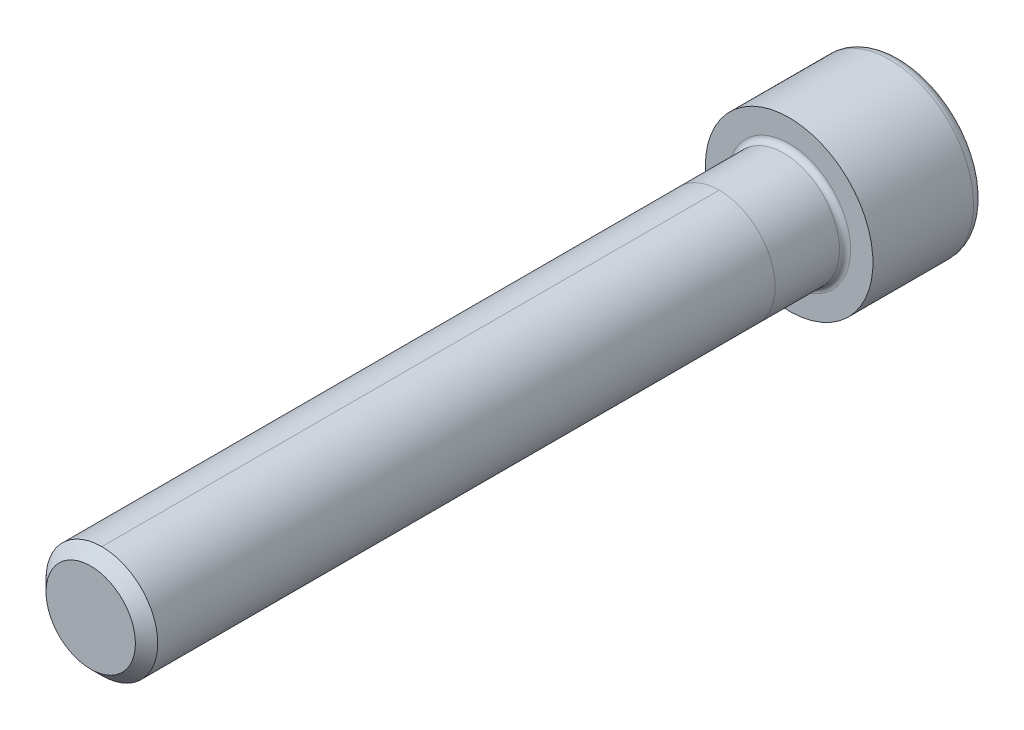
ISO-10303-21;
HEADER;
FILE_DESCRIPTION(('STEP AP214'),'2;1');
FILE_NAME('part.step','',(''),(''),'','','');
FILE_SCHEMA(('AUTOMOTIVE_DESIGN { 1 0 10303 214 1 1 1 1 }'));
ENDSEC;
DATA;
#1=APPLICATION_CONTEXT('core data for automotive mechanical design processes');
#2=APPLICATION_PROTOCOL_DEFINITION('international standard','automotive_design',2000,#1);
#3=PRODUCT_CONTEXT('',#1,'mechanical');
#4=PRODUCT('Part','Part','',(#3));
#5=PRODUCT_RELATED_PRODUCT_CATEGORY('part','',(#4));
#6=PRODUCT_DEFINITION_FORMATION('','',#4);
#7=PRODUCT_DEFINITION_CONTEXT('part definition',#1,'design');
#8=PRODUCT_DEFINITION('design','',#6,#7);
#9=PRODUCT_DEFINITION_SHAPE('','',#8);
#10=(LENGTH_UNIT() NAMED_UNIT(*) SI_UNIT(.MILLI.,.METRE.));
#11=(NAMED_UNIT(*) PLANE_ANGLE_UNIT() SI_UNIT($,.RADIAN.));
#12=(NAMED_UNIT(*) SI_UNIT($,.STERADIAN.) SOLID_ANGLE_UNIT());
#13=UNCERTAINTY_MEASURE_WITH_UNIT(LENGTH_MEASURE(1.E-05),#10,'distance_accuracy_value','');
#14=(GEOMETRIC_REPRESENTATION_CONTEXT(3) GLOBAL_UNCERTAINTY_ASSIGNED_CONTEXT((#13)) GLOBAL_UNIT_ASSIGNED_CONTEXT((#10,
#11,#12)) REPRESENTATION_CONTEXT('',''));
#15=CARTESIAN_POINT('',(0.,0.,0.));
#16=DIRECTION('',(0.,0.,1.));
#17=DIRECTION('',(1.,0.,0.));
#18=AXIS2_PLACEMENT_3D('',#15,#16,#17);
#19=CARTESIAN_POINT('',(0.,0.,75.));
#20=DIRECTION('',(0.,0.,-1.));
#21=DIRECTION('',(-1.,0.,0.));
#22=AXIS2_PLACEMENT_3D('',#19,#20,#21);
#23=CYLINDRICAL_SURFACE('',#22,6.);
#24=DIRECTION('',(0.,0.,-1.));
#25=VECTOR('',#24,1.);
#26=CARTESIAN_POINT('',(0.,6.,75.));
#27=LINE('',#26,#25);
#28=CARTESIAN_POINT('',(0.,6.,73.8));
#29=VERTEX_POINT('',#28);
#30=CARTESIAN_POINT('',(0.,6.,7.49999999999999));
#31=VERTEX_POINT('',#30);
#32=EDGE_CURVE('E58',#29,#31,#27,.T.);
#33=ORIENTED_EDGE('',*,*,#32,.F.);
#34=CARTESIAN_POINT('',(0.,0.,73.8));
#35=DIRECTION('',(0.,0.,1.));
#36=DIRECTION('',(1.,0.,0.));
#37=AXIS2_PLACEMENT_3D('',#34,#35,#36);
#38=CIRCLE('',#37,6.);
#39=CARTESIAN_POINT('',(0.,-6.,73.8));
#40=VERTEX_POINT('',#39);
#41=EDGE_CURVE('E192',#29,#40,#38,.F.);
#42=ORIENTED_EDGE('',*,*,#41,.T.);
#43=DIRECTION('',(0.,0.,-1.));
#44=VECTOR('',#43,1.);
#45=CARTESIAN_POINT('',(0.,-6.00000000000001,75.));
#46=LINE('',#45,#44);
#47=CARTESIAN_POINT('',(0.,-6.00000000000001,7.49999999999999));
#48=VERTEX_POINT('',#47);
#49=EDGE_CURVE('E195',#40,#48,#46,.T.);
#50=ORIENTED_EDGE('',*,*,#49,.T.);
#51=CARTESIAN_POINT('',(0.,0.,7.49999999999999));
#52=DIRECTION('',(0.,0.,1.));
#53=DIRECTION('',(0.,-1.,0.));
#54=AXIS2_PLACEMENT_3D('',#51,#52,#53);
#55=CIRCLE('',#54,6.);
#56=EDGE_CURVE('E64',#48,#31,#55,.T.);
#57=ORIENTED_EDGE('',*,*,#56,.T.);
#58=EDGE_LOOP('',(#33,#42,#50,#57));
#59=FACE_BOUND('',#58,.T.);
#60=ADVANCED_FACE('F43',(#59),#23,.T.);
#61=CARTESIAN_POINT('',(0.,0.,0.600000000000003));
#62=DIRECTION('',(0.,0.,-1.));
#63=DIRECTION('',(-1.,0.,0.));
#64=AXIS2_PLACEMENT_3D('',#61,#62,#63);
#65=CIRCLE('',#64,6.);
#66=CARTESIAN_POINT('',(-6.,0.,0.600000000000003));
#67=VERTEX_POINT('',#66);
#68=EDGE_CURVE('E12',#67,#67,#65,.F.);
#69=ORIENTED_EDGE('',*,*,#68,.T.);
#70=EDGE_LOOP('',(#69));
#71=FACE_BOUND('',#70,.T.);
#72=ORIENTED_EDGE('',*,*,#56,.F.);
#73=EDGE_CURVE('E217',#31,#48,#55,.T.);
#74=ORIENTED_EDGE('',*,*,#73,.F.);
#75=EDGE_LOOP('',(#72,#74));
#76=FACE_BOUND('',#75,.T.);
#77=ADVANCED_FACE('F235',(#71,#76),#23,.T.);
#78=EDGE_CURVE('E193',#40,#29,#38,.F.);
#79=ORIENTED_EDGE('',*,*,#78,.T.);
#80=ORIENTED_EDGE('',*,*,#32,.T.);
#81=ORIENTED_EDGE('',*,*,#73,.T.);
#82=ORIENTED_EDGE('',*,*,#49,.F.);
#83=EDGE_LOOP('',(#79,#80,#81,#82));
#84=FACE_BOUND('',#83,.T.);
#85=ADVANCED_FACE('F238',(#84),#23,.T.);
#86=CARTESIAN_POINT('',(0.,0.,75.));
#87=DIRECTION('',(0.,0.,1.));
#88=DIRECTION('',(1.,0.,0.));
#89=AXIS2_PLACEMENT_3D('',#86,#87,#88);
#90=PLANE('',#89);
#91=CARTESIAN_POINT('',(0.,0.,75.));
#92=DIRECTION('',(0.,0.,1.));
#93=DIRECTION('',(1.,0.,0.));
#94=AXIS2_PLACEMENT_3D('',#91,#92,#93);
#95=CIRCLE('',#94,4.8);
#96=CARTESIAN_POINT('',(4.8,0.,75.));
#97=VERTEX_POINT('',#96);
#98=EDGE_CURVE('E189',#97,#97,#95,.T.);
#99=ORIENTED_EDGE('',*,*,#98,.T.);
#100=EDGE_LOOP('',(#99));
#101=FACE_BOUND('',#100,.T.);
#102=ADVANCED_FACE('F246',(#101),#90,.T.);
#103=CARTESIAN_POINT('',(0.,0.,0.));
#104=DIRECTION('',(0.,0.,-1.));
#105=DIRECTION('',(-1.,0.,0.));
#106=AXIS2_PLACEMENT_3D('',#103,#104,#105);
#107=PLANE('',#106);
#108=CARTESIAN_POINT('',(0.,0.,0.));
#109=DIRECTION('',(0.,0.,-1.));
#110=DIRECTION('',(-1.,0.,0.));
#111=AXIS2_PLACEMENT_3D('',#108,#109,#110);
#112=CIRCLE('',#111,6.6);
#113=CARTESIAN_POINT('',(-6.6,0.,0.));
#114=VERTEX_POINT('',#113);
#115=EDGE_CURVE('E51',#114,#114,#112,.T.);
#116=ORIENTED_EDGE('',*,*,#115,.T.);
#117=EDGE_LOOP('',(#116));
#118=FACE_BOUND('',#117,.T.);
#119=CARTESIAN_POINT('',(0.,0.,0.));
#120=DIRECTION('',(0.,0.,-1.));
#121=DIRECTION('',(-1.,0.,0.));
#122=AXIS2_PLACEMENT_3D('',#119,#120,#121);
#123=CIRCLE('',#122,9.);
#124=CARTESIAN_POINT('',(-9.,0.,0.));
#125=VERTEX_POINT('',#124);
#126=EDGE_CURVE('E179',#125,#125,#123,.T.);
#127=ORIENTED_EDGE('',*,*,#126,.F.);
#128=EDGE_LOOP('',(#127));
#129=FACE_BOUND('',#128,.T.);
#130=ADVANCED_FACE('F224',(#118,#129),#107,.F.);
#131=CARTESIAN_POINT('',(0.,0.,-12.));
#132=DIRECTION('',(0.,0.,1.));
#133=DIRECTION('',(1.,0.,0.));
#134=AXIS2_PLACEMENT_3D('',#131,#132,#133);
#135=CYLINDRICAL_SURFACE('',#134,9.);
#136=CARTESIAN_POINT('',(0.,0.,-10.8));
#137=DIRECTION('',(0.,0.,-1.));
#138=DIRECTION('',(-1.,0.,0.));
#139=AXIS2_PLACEMENT_3D('',#136,#137,#138);
#140=CIRCLE('',#139,9.);
#141=CARTESIAN_POINT('',(-9.,0.,-10.8));
#142=VERTEX_POINT('',#141);
#143=EDGE_CURVE('E186',#142,#142,#140,.F.);
#144=ORIENTED_EDGE('',*,*,#143,.T.);
#145=EDGE_LOOP('',(#144));
#146=FACE_BOUND('',#145,.T.);
#147=ORIENTED_EDGE('',*,*,#126,.T.);
#148=EDGE_LOOP('',(#147));
#149=FACE_BOUND('',#148,.T.);
#150=ADVANCED_FACE('F282',(#146,#149),#135,.T.);
#151=CARTESIAN_POINT('',(0.,0.,-12.));
#152=DIRECTION('',(0.,0.,-1.));
#153=DIRECTION('',(-1.,0.,0.));
#154=AXIS2_PLACEMENT_3D('',#151,#152,#153);
#155=PLANE('',#154);
#156=DIRECTION('',(0.5,-0.866025403784439,0.));
#157=VECTOR('',#156,1.);
#158=CARTESIAN_POINT('',(2.88675134594813,5.,-12.));
#159=LINE('',#158,#157);
#160=CARTESIAN_POINT('',(2.88675134594813,5.,-12.));
#161=VERTEX_POINT('',#160);
#162=CARTESIAN_POINT('',(5.77350269189626,0.,-12.));
#163=VERTEX_POINT('',#162);
#164=EDGE_CURVE('E122',#161,#163,#159,.T.);
#165=ORIENTED_EDGE('',*,*,#164,.F.);
#166=DIRECTION('',(1.,0.,0.));
#167=VECTOR('',#166,1.);
#168=CARTESIAN_POINT('',(-2.88675134594813,5.,-12.));
#169=LINE('',#168,#167);
#170=CARTESIAN_POINT('',(-2.88675134594813,5.,-12.));
#171=VERTEX_POINT('',#170);
#172=EDGE_CURVE('E176',#171,#161,#169,.T.);
#173=ORIENTED_EDGE('',*,*,#172,.F.);
#174=DIRECTION('',(0.5,0.866025403784439,0.));
#175=VECTOR('',#174,1.);
#176=CARTESIAN_POINT('',(-5.77350269189626,0.,-12.));
#177=LINE('',#176,#175);
#178=CARTESIAN_POINT('',(-5.77350269189626,0.,-12.));
#179=VERTEX_POINT('',#178);
#180=EDGE_CURVE('E173',#179,#171,#177,.T.);
#181=ORIENTED_EDGE('',*,*,#180,.F.);
#182=DIRECTION('',(-0.5,0.866025403784439,0.));
#183=VECTOR('',#182,1.);
#184=CARTESIAN_POINT('',(-2.88675134594813,-5.,-12.));
#185=LINE('',#184,#183);
#186=CARTESIAN_POINT('',(-2.88675134594813,-5.,-12.));
#187=VERTEX_POINT('',#186);
#188=EDGE_CURVE('E170',#187,#179,#185,.T.);
#189=ORIENTED_EDGE('',*,*,#188,.F.);
#190=DIRECTION('',(-1.,0.,0.));
#191=VECTOR('',#190,1.);
#192=CARTESIAN_POINT('',(2.88675134594813,-5.,-12.));
#193=LINE('',#192,#191);
#194=CARTESIAN_POINT('',(2.88675134594813,-5.,-12.));
#195=VERTEX_POINT('',#194);
#196=EDGE_CURVE('E167',#195,#187,#193,.T.);
#197=ORIENTED_EDGE('',*,*,#196,.F.);
#198=DIRECTION('',(-0.5,-0.866025403784439,0.));
#199=VECTOR('',#198,1.);
#200=CARTESIAN_POINT('',(5.77350269189626,0.,-12.));
#201=LINE('',#200,#199);
#202=EDGE_CURVE('E164',#163,#195,#201,.T.);
#203=ORIENTED_EDGE('',*,*,#202,.F.);
#204=EDGE_LOOP('',(#165,#173,#181,#189,#197,#203));
#205=FACE_BOUND('',#204,.T.);
#206=CARTESIAN_POINT('',(0.,0.,-12.));
#207=DIRECTION('',(0.,0.,-1.));
#208=DIRECTION('',(-1.,0.,0.));
#209=AXIS2_PLACEMENT_3D('',#206,#207,#208);
#210=CIRCLE('',#209,7.8);
#211=CARTESIAN_POINT('',(-7.8,0.,-12.));
#212=VERTEX_POINT('',#211);
#213=EDGE_CURVE('E182',#212,#212,#210,.T.);
#214=ORIENTED_EDGE('',*,*,#213,.T.);
#215=EDGE_LOOP('',(#214));
#216=FACE_BOUND('',#215,.T.);
#217=ADVANCED_FACE('F277',(#205,#216),#155,.T.);
#218=CARTESIAN_POINT('',(0.,0.,-10.8));
#219=DIRECTION('',(0.,0.,-1.));
#220=DIRECTION('',(-1.,0.,0.));
#221=AXIS2_PLACEMENT_3D('',#218,#219,#220);
#222=TOROIDAL_SURFACE('',#221,7.8,1.2);
#223=ORIENTED_EDGE('',*,*,#143,.F.);
#224=EDGE_LOOP('',(#223));
#225=FACE_BOUND('',#224,.T.);
#226=ORIENTED_EDGE('',*,*,#213,.F.);
#227=EDGE_LOOP('',(#226));
#228=FACE_BOUND('',#227,.T.);
#229=ADVANCED_FACE('F268',(#225,#228),#222,.T.);
#230=CARTESIAN_POINT('',(0.,0.,75.));
#231=DIRECTION('',(0.,0.,-1.));
#232=DIRECTION('',(-1.,0.,0.));
#233=AXIS2_PLACEMENT_3D('',#230,#231,#232);
#234=CONICAL_SURFACE('',#233,4.8,0.785398163397452);
#235=ORIENTED_EDGE('',*,*,#78,.F.);
#236=ORIENTED_EDGE('',*,*,#41,.F.);
#237=EDGE_LOOP('',(#235,#236));
#238=FACE_BOUND('',#237,.T.);
#239=ORIENTED_EDGE('',*,*,#98,.F.);
#240=EDGE_LOOP('',(#239));
#241=FACE_BOUND('',#240,.T.);
#242=ADVANCED_FACE('F255',(#238,#241),#234,.T.);
#243=CARTESIAN_POINT('',(2.88675134594813,5.,-7.55555555555556));
#244=DIRECTION('',(0.866025403784439,0.5,0.));
#245=DIRECTION('',(-0.5,0.866025403784439,0.));
#246=AXIS2_PLACEMENT_3D('',#243,#244,#245);
#247=PLANE('',#246);
#248=ORIENTED_EDGE('',*,*,#164,.T.);
#249=DIRECTION('',(0.,0.,-1.));
#250=VECTOR('',#249,1.);
#251=CARTESIAN_POINT('',(5.77350269189626,0.,-7.55555555555556));
#252=LINE('',#251,#250);
#253=CARTESIAN_POINT('',(5.77350269189626,0.,-7.55555555555556));
#254=VERTEX_POINT('',#253);
#255=EDGE_CURVE('E200',#254,#163,#252,.T.);
#256=ORIENTED_EDGE('',*,*,#255,.F.);
#257=DIRECTION('',(-0.5,0.866025403784439,0.));
#258=VECTOR('',#257,1.);
#259=CARTESIAN_POINT('',(5.77350269189626,0.,-7.55555555555556));
#260=LINE('',#259,#258);
#261=CARTESIAN_POINT('',(2.88675134594813,5.,-7.55555555555556));
#262=VERTEX_POINT('',#261);
#263=EDGE_CURVE('E117',#262,#254,#260,.F.);
#264=ORIENTED_EDGE('',*,*,#263,.F.);
#265=DIRECTION('',(0.,0.,-1.));
#266=VECTOR('',#265,1.);
#267=CARTESIAN_POINT('',(2.88675134594813,5.,-7.55555555555556));
#268=LINE('',#267,#266);
#269=EDGE_CURVE('E183',#262,#161,#268,.T.);
#270=ORIENTED_EDGE('',*,*,#269,.T.);
#271=EDGE_LOOP('',(#248,#256,#264,#270));
#272=FACE_BOUND('',#271,.T.);
#273=ADVANCED_FACE('F267',(#272),#247,.F.);
#274=CARTESIAN_POINT('',(-2.88675134594813,5.,-7.55555555555556));
#275=DIRECTION('',(0.,1.,0.));
#276=DIRECTION('',(-1.,0.,0.));
#277=AXIS2_PLACEMENT_3D('',#274,#275,#276);
#278=PLANE('',#277);
#279=ORIENTED_EDGE('',*,*,#172,.T.);
#280=ORIENTED_EDGE('',*,*,#269,.F.);
#281=DIRECTION('',(1.,0.,0.));
#282=VECTOR('',#281,1.);
#283=CARTESIAN_POINT('',(0.,5.,-7.55555555555556));
#284=LINE('',#283,#282);
#285=CARTESIAN_POINT('',(-2.88675134594813,5.,-7.55555555555556));
#286=VERTEX_POINT('',#285);
#287=EDGE_CURVE('E131',#286,#262,#284,.T.);
#288=ORIENTED_EDGE('',*,*,#287,.F.);
#289=DIRECTION('',(0.,0.,-1.));
#290=VECTOR('',#289,1.);
#291=CARTESIAN_POINT('',(-2.88675134594813,5.,-7.55555555555556));
#292=LINE('',#291,#290);
#293=EDGE_CURVE('E196',#286,#171,#292,.T.);
#294=ORIENTED_EDGE('',*,*,#293,.T.);
#295=EDGE_LOOP('',(#279,#280,#288,#294));
#296=FACE_BOUND('',#295,.T.);
#297=ADVANCED_FACE('F274',(#296),#278,.F.);
#298=CARTESIAN_POINT('',(-5.77350269189626,0.,-7.55555555555556));
#299=DIRECTION('',(-0.866025403784439,0.5,0.));
#300=DIRECTION('',(-0.5,-0.866025403784439,0.));
#301=AXIS2_PLACEMENT_3D('',#298,#299,#300);
#302=PLANE('',#301);
#303=ORIENTED_EDGE('',*,*,#180,.T.);
#304=ORIENTED_EDGE('',*,*,#293,.F.);
#305=DIRECTION('',(-0.5,-0.866025403784439,0.));
#306=VECTOR('',#305,1.);
#307=CARTESIAN_POINT('',(-2.88675134594813,5.,-7.55555555555556));
#308=LINE('',#307,#306);
#309=CARTESIAN_POINT('',(-5.77350269189626,0.,-7.55555555555556));
#310=VERTEX_POINT('',#309);
#311=EDGE_CURVE('E139',#310,#286,#308,.F.);
#312=ORIENTED_EDGE('',*,*,#311,.F.);
#313=DIRECTION('',(0.,0.,-1.));
#314=VECTOR('',#313,1.);
#315=CARTESIAN_POINT('',(-5.77350269189626,0.,-7.55555555555556));
#316=LINE('',#315,#314);
#317=EDGE_CURVE('E198',#310,#179,#316,.T.);
#318=ORIENTED_EDGE('',*,*,#317,.T.);
#319=EDGE_LOOP('',(#303,#304,#312,#318));
#320=FACE_BOUND('',#319,.T.);
#321=ADVANCED_FACE('F310',(#320),#302,.F.);
#322=CARTESIAN_POINT('',(-2.88675134594813,-5.,-7.55555555555556));
#323=DIRECTION('',(-0.866025403784439,-0.5,0.));
#324=DIRECTION('',(0.5,-0.866025403784439,0.));
#325=AXIS2_PLACEMENT_3D('',#322,#323,#324);
#326=PLANE('',#325);
#327=ORIENTED_EDGE('',*,*,#188,.T.);
#328=ORIENTED_EDGE('',*,*,#317,.F.);
#329=DIRECTION('',(0.5,-0.866025403784439,0.));
#330=VECTOR('',#329,1.);
#331=CARTESIAN_POINT('',(-5.77350269189626,0.,-7.55555555555556));
#332=LINE('',#331,#330);
#333=CARTESIAN_POINT('',(-2.88675134594813,-5.,-7.55555555555556));
#334=VERTEX_POINT('',#333);
#335=EDGE_CURVE('E147',#334,#310,#332,.F.);
#336=ORIENTED_EDGE('',*,*,#335,.F.);
#337=DIRECTION('',(0.,0.,-1.));
#338=VECTOR('',#337,1.);
#339=CARTESIAN_POINT('',(-2.88675134594813,-5.,-7.55555555555556));
#340=LINE('',#339,#338);
#341=EDGE_CURVE('E205',#334,#187,#340,.T.);
#342=ORIENTED_EDGE('',*,*,#341,.T.);
#343=EDGE_LOOP('',(#327,#328,#336,#342));
#344=FACE_BOUND('',#343,.T.);
#345=ADVANCED_FACE('F306',(#344),#326,.F.);
#346=CARTESIAN_POINT('',(2.88675134594813,-5.,-7.55555555555556));
#347=DIRECTION('',(0.,-1.,0.));
#348=DIRECTION('',(1.,0.,0.));
#349=AXIS2_PLACEMENT_3D('',#346,#347,#348);
#350=PLANE('',#349);
#351=ORIENTED_EDGE('',*,*,#196,.T.);
#352=ORIENTED_EDGE('',*,*,#341,.F.);
#353=DIRECTION('',(1.,0.,0.));
#354=VECTOR('',#353,1.);
#355=CARTESIAN_POINT('',(0.,-5.,-7.55555555555556));
#356=LINE('',#355,#354);
#357=CARTESIAN_POINT('',(2.88675134594813,-5.,-7.55555555555556));
#358=VERTEX_POINT('',#357);
#359=EDGE_CURVE('E154',#358,#334,#356,.F.);
#360=ORIENTED_EDGE('',*,*,#359,.F.);
#361=DIRECTION('',(0.,0.,-1.));
#362=VECTOR('',#361,1.);
#363=CARTESIAN_POINT('',(2.88675134594813,-5.,-7.55555555555556));
#364=LINE('',#363,#362);
#365=EDGE_CURVE('E203',#358,#195,#364,.T.);
#366=ORIENTED_EDGE('',*,*,#365,.T.);
#367=EDGE_LOOP('',(#351,#352,#360,#366));
#368=FACE_BOUND('',#367,.T.);
#369=ADVANCED_FACE('F302',(#368),#350,.F.);
#370=CARTESIAN_POINT('',(5.77350269189626,0.,-7.55555555555556));
#371=DIRECTION('',(0.866025403784439,-0.5,0.));
#372=DIRECTION('',(0.5,0.866025403784439,0.));
#373=AXIS2_PLACEMENT_3D('',#370,#371,#372);
#374=PLANE('',#373);
#375=ORIENTED_EDGE('',*,*,#202,.T.);
#376=ORIENTED_EDGE('',*,*,#365,.F.);
#377=DIRECTION('',(0.5,0.866025403784439,0.));
#378=VECTOR('',#377,1.);
#379=CARTESIAN_POINT('',(2.88675134594813,-5.00000000000001,-7.55555555555556));
#380=LINE('',#379,#378);
#381=EDGE_CURVE('E159',#254,#358,#380,.F.);
#382=ORIENTED_EDGE('',*,*,#381,.F.);
#383=ORIENTED_EDGE('',*,*,#255,.T.);
#384=EDGE_LOOP('',(#375,#376,#382,#383));
#385=FACE_BOUND('',#384,.T.);
#386=ADVANCED_FACE('F299',(#385),#374,.F.);
#387=CARTESIAN_POINT('',(-1.57942379646789,-0.911880754055239,-5.12932924156072));
#388=DIRECTION('',(0.290126882702444,0.167504833827403,0.942214690279141));
#389=DIRECTION('',(0.955717783517745,0.,-0.294284757111084));
#390=AXIS2_PLACEMENT_3D('',#387,#388,#389);
#391=PLANE('',#390);
#392=DIRECTION('',(-0.477858891758872,-0.827675879374923,0.294284757111084));
#393=VECTOR('',#392,1.);
#394=CARTESIAN_POINT('',(2.88675134594813,5.,-7.55555555555556));
#395=LINE('',#394,#393);
#396=CARTESIAN_POINT('',(0.,0.,-5.77777777777778));
#397=VERTEX_POINT('',#396);
#398=EDGE_CURVE('E114',#262,#397,#395,.T.);
#399=ORIENTED_EDGE('',*,*,#398,.F.);
#400=ORIENTED_EDGE('',*,*,#263,.T.);
#401=DIRECTION('',(-0.955717783517745,0.,0.294284757111084));
#402=VECTOR('',#401,1.);
#403=CARTESIAN_POINT('',(5.77350269189626,0.,-7.55555555555556));
#404=LINE('',#403,#402);
#405=EDGE_CURVE('E111',#254,#397,#404,.T.);
#406=ORIENTED_EDGE('',*,*,#405,.T.);
#407=EDGE_LOOP('',(#399,#400,#406));
#408=FACE_BOUND('',#407,.T.);
#409=ADVANCED_FACE('F113',(#408),#391,.F.);
#410=CARTESIAN_POINT('',(-1.57942379646789,0.911880754055239,-5.12932924156072));
#411=DIRECTION('',(0.290126882702444,-0.167504833827403,0.942214690279141));
#412=DIRECTION('',(0.955717783517745,0.,-0.294284757111084));
#413=AXIS2_PLACEMENT_3D('',#410,#411,#412);
#414=PLANE('',#413);
#415=ORIENTED_EDGE('',*,*,#405,.F.);
#416=ORIENTED_EDGE('',*,*,#381,.T.);
#417=DIRECTION('',(-0.477858891758872,0.827675879374923,0.294284757111084));
#418=VECTOR('',#417,1.);
#419=CARTESIAN_POINT('',(2.88675134594813,-5.,-7.55555555555556));
#420=LINE('',#419,#418);
#421=EDGE_CURVE('E152',#358,#397,#420,.T.);
#422=ORIENTED_EDGE('',*,*,#421,.T.);
#423=EDGE_LOOP('',(#415,#416,#422));
#424=FACE_BOUND('',#423,.T.);
#425=ADVANCED_FACE('F157',(#424),#414,.F.);
#426=CARTESIAN_POINT('',(0.,-1.82376150811048,-5.12932924156072));
#427=DIRECTION('',(0.,0.335009667654806,0.942214690279141));
#428=DIRECTION('',(0.,-0.942214690279141,0.335009667654806));
#429=AXIS2_PLACEMENT_3D('',#426,#427,#428);
#430=PLANE('',#429);
#431=DIRECTION('',(0.477858891758872,-0.827675879374923,0.294284757111084));
#432=VECTOR('',#431,1.);
#433=CARTESIAN_POINT('',(-2.88675134594813,5.,-7.55555555555556));
#434=LINE('',#433,#432);
#435=EDGE_CURVE('E128',#286,#397,#434,.T.);
#436=ORIENTED_EDGE('',*,*,#435,.F.);
#437=ORIENTED_EDGE('',*,*,#287,.T.);
#438=ORIENTED_EDGE('',*,*,#398,.T.);
#439=EDGE_LOOP('',(#436,#437,#438));
#440=FACE_BOUND('',#439,.T.);
#441=ADVANCED_FACE('F127',(#440),#430,.F.);
#442=CARTESIAN_POINT('',(1.57942379646789,-0.911880754055239,-5.12932924156072));
#443=DIRECTION('',(-0.290126882702444,0.167504833827403,0.942214690279141));
#444=DIRECTION('',(0.955717783517744,0.,0.294284757111084));
#445=AXIS2_PLACEMENT_3D('',#442,#443,#444);
#446=PLANE('',#445);
#447=DIRECTION('',(0.955717783517745,0.,0.294284757111084));
#448=VECTOR('',#447,1.);
#449=CARTESIAN_POINT('',(-5.77350269189626,0.,-7.55555555555556));
#450=LINE('',#449,#448);
#451=EDGE_CURVE('E136',#310,#397,#450,.T.);
#452=ORIENTED_EDGE('',*,*,#451,.F.);
#453=ORIENTED_EDGE('',*,*,#311,.T.);
#454=ORIENTED_EDGE('',*,*,#435,.T.);
#455=EDGE_LOOP('',(#452,#453,#454));
#456=FACE_BOUND('',#455,.T.);
#457=ADVANCED_FACE('F135',(#456),#446,.F.);
#458=CARTESIAN_POINT('',(1.57942379646789,0.911880754055239,-5.12932924156072));
#459=DIRECTION('',(-0.290126882702444,-0.167504833827403,0.942214690279141));
#460=DIRECTION('',(0.955717783517744,0.,0.294284757111084));
#461=AXIS2_PLACEMENT_3D('',#458,#459,#460);
#462=PLANE('',#461);
#463=DIRECTION('',(0.477858891758872,0.827675879374923,0.294284757111084));
#464=VECTOR('',#463,1.);
#465=CARTESIAN_POINT('',(-2.88675134594813,-5.,-7.55555555555556));
#466=LINE('',#465,#464);
#467=EDGE_CURVE('E144',#334,#397,#466,.T.);
#468=ORIENTED_EDGE('',*,*,#467,.F.);
#469=ORIENTED_EDGE('',*,*,#335,.T.);
#470=ORIENTED_EDGE('',*,*,#451,.T.);
#471=EDGE_LOOP('',(#468,#469,#470));
#472=FACE_BOUND('',#471,.T.);
#473=ADVANCED_FACE('F143',(#472),#462,.F.);
#474=CARTESIAN_POINT('',(0.,1.82376150811048,-5.12932924156072));
#475=DIRECTION('',(0.,-0.335009667654806,0.942214690279141));
#476=DIRECTION('',(0.,-0.942214690279141,-0.335009667654806));
#477=AXIS2_PLACEMENT_3D('',#474,#475,#476);
#478=PLANE('',#477);
#479=ORIENTED_EDGE('',*,*,#421,.F.);
#480=ORIENTED_EDGE('',*,*,#359,.T.);
#481=ORIENTED_EDGE('',*,*,#467,.T.);
#482=EDGE_LOOP('',(#479,#480,#481));
#483=FACE_BOUND('',#482,.T.);
#484=ADVANCED_FACE('F151',(#483),#478,.F.);
#485=CARTESIAN_POINT('',(0.,0.,0.600000000000003));
#486=DIRECTION('',(0.,0.,-1.));
#487=DIRECTION('',(-1.,0.,0.));
#488=AXIS2_PLACEMENT_3D('',#485,#486,#487);
#489=TOROIDAL_SURFACE('',#488,6.6,0.6);
#490=ORIENTED_EDGE('',*,*,#68,.F.);
#491=EDGE_LOOP('',(#490));
#492=FACE_BOUND('',#491,.T.);
#493=ORIENTED_EDGE('',*,*,#115,.F.);
#494=EDGE_LOOP('',(#493));
#495=FACE_BOUND('',#494,.T.);
#496=ADVANCED_FACE('F45',(#492,#495),#489,.F.);
#497=CLOSED_SHELL('',(#60,#77,#85,#102,#130,#150,#217,#229,#242,#273,#297,#321,#345,#369,#386,
#409,#425,#441,#457,#473,#484,#496));
#498=MANIFOLD_SOLID_BREP('B2',#497);
#499=ADVANCED_BREP_SHAPE_REPRESENTATION('',(#18,#498),#14);
#500=SHAPE_DEFINITION_REPRESENTATION(#9,#499);
ENDSEC;
END-ISO-10303-21;
